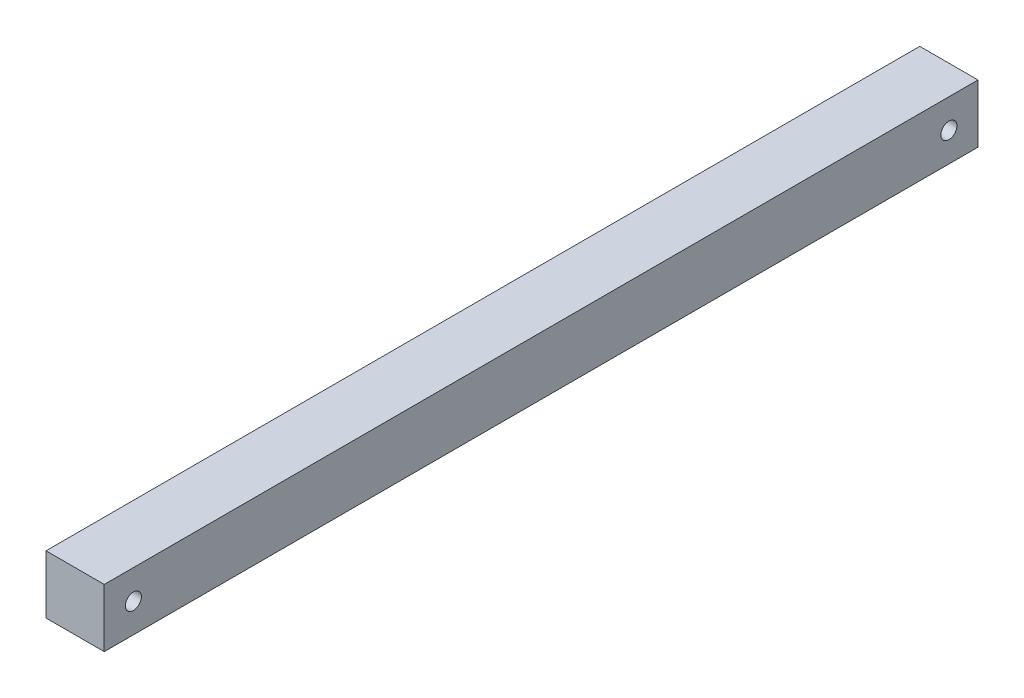
ISO-10303-21;
HEADER;
FILE_DESCRIPTION(('STEP AP214'),'2;1');
FILE_NAME('part.step','',(''),(''),'','','');
FILE_SCHEMA(('AUTOMOTIVE_DESIGN { 1 0 10303 214 1 1 1 1 }'));
ENDSEC;
DATA;
#1=APPLICATION_CONTEXT('core data for automotive mechanical design processes');
#2=APPLICATION_PROTOCOL_DEFINITION('international standard','automotive_design',2000,#1);
#3=PRODUCT_CONTEXT('',#1,'mechanical');
#4=PRODUCT('Part','Part','',(#3));
#5=PRODUCT_RELATED_PRODUCT_CATEGORY('part','',(#4));
#6=PRODUCT_DEFINITION_FORMATION('','',#4);
#7=PRODUCT_DEFINITION_CONTEXT('part definition',#1,'design');
#8=PRODUCT_DEFINITION('design','',#6,#7);
#9=PRODUCT_DEFINITION_SHAPE('','',#8);
#10=(LENGTH_UNIT() NAMED_UNIT(*) SI_UNIT(.MILLI.,.METRE.));
#11=(NAMED_UNIT(*) PLANE_ANGLE_UNIT() SI_UNIT($,.RADIAN.));
#12=(NAMED_UNIT(*) SI_UNIT($,.STERADIAN.) SOLID_ANGLE_UNIT());
#13=UNCERTAINTY_MEASURE_WITH_UNIT(LENGTH_MEASURE(1.E-05),#10,'distance_accuracy_value','');
#14=(GEOMETRIC_REPRESENTATION_CONTEXT(3) GLOBAL_UNCERTAINTY_ASSIGNED_CONTEXT((#13)) GLOBAL_UNIT_ASSIGNED_CONTEXT((#10,
#11,#12)) REPRESENTATION_CONTEXT('',''));
#15=CARTESIAN_POINT('',(0.,0.,0.));
#16=DIRECTION('',(0.,0.,1.));
#17=DIRECTION('',(1.,0.,0.));
#18=AXIS2_PLACEMENT_3D('',#15,#16,#17);
#19=CARTESIAN_POINT('',(12.7,-12.7,381.));
#20=DIRECTION('',(-1.,0.,0.));
#21=DIRECTION('',(0.,0.,1.));
#22=AXIS2_PLACEMENT_3D('',#19,#20,#21);
#23=PLANE('',#22);
#24=CARTESIAN_POINT('',(12.7,0.,368.3));
#25=DIRECTION('',(-1.,0.,0.));
#26=DIRECTION('',(0.,0.,1.));
#27=AXIS2_PLACEMENT_3D('',#24,#25,#26);
#28=CIRCLE('',#27,3.50000000000002);
#29=CARTESIAN_POINT('',(12.7,0.,371.8));
#30=VERTEX_POINT('',#29);
#31=EDGE_CURVE('E111',#30,#30,#28,.T.);
#32=ORIENTED_EDGE('',*,*,#31,.T.);
#33=EDGE_LOOP('',(#32));
#34=FACE_BOUND('',#33,.T.);
#35=CARTESIAN_POINT('',(12.7,0.,12.7));
#36=DIRECTION('',(-1.,0.,0.));
#37=DIRECTION('',(0.,0.,-1.));
#38=AXIS2_PLACEMENT_3D('',#35,#36,#37);
#39=CIRCLE('',#38,3.50000000000003);
#40=CARTESIAN_POINT('',(12.7,0.,9.19999999999996));
#41=VERTEX_POINT('',#40);
#42=EDGE_CURVE('E132',#41,#41,#39,.T.);
#43=ORIENTED_EDGE('',*,*,#42,.T.);
#44=EDGE_LOOP('',(#43));
#45=FACE_BOUND('',#44,.T.);
#46=DIRECTION('',(0.,1.,0.));
#47=VECTOR('',#46,1.);
#48=CARTESIAN_POINT('',(12.7,-12.7,0.));
#49=LINE('',#48,#47);
#50=CARTESIAN_POINT('',(12.7,-12.7,0.));
#51=VERTEX_POINT('',#50);
#52=CARTESIAN_POINT('',(12.7,12.7,0.));
#53=VERTEX_POINT('',#52);
#54=EDGE_CURVE('E107',#51,#53,#49,.T.);
#55=ORIENTED_EDGE('',*,*,#54,.T.);
#56=DIRECTION('',(0.,0.,-1.));
#57=VECTOR('',#56,1.);
#58=CARTESIAN_POINT('',(12.7,12.7,381.));
#59=LINE('',#58,#57);
#60=CARTESIAN_POINT('',(12.7,12.7,381.));
#61=VERTEX_POINT('',#60);
#62=EDGE_CURVE('E11',#61,#53,#59,.T.);
#63=ORIENTED_EDGE('',*,*,#62,.F.);
#64=DIRECTION('',(0.,1.,0.));
#65=VECTOR('',#64,1.);
#66=CARTESIAN_POINT('',(12.7,-12.7,381.));
#67=LINE('',#66,#65);
#68=CARTESIAN_POINT('',(12.7,-12.7,381.));
#69=VERTEX_POINT('',#68);
#70=EDGE_CURVE('E91',#69,#61,#67,.T.);
#71=ORIENTED_EDGE('',*,*,#70,.F.);
#72=DIRECTION('',(0.,0.,-1.));
#73=VECTOR('',#72,1.);
#74=CARTESIAN_POINT('',(12.7,-12.7,381.));
#75=LINE('',#74,#73);
#76=EDGE_CURVE('E103',#69,#51,#75,.T.);
#77=ORIENTED_EDGE('',*,*,#76,.T.);
#78=EDGE_LOOP('',(#55,#63,#71,#77));
#79=FACE_BOUND('',#78,.T.);
#80=ADVANCED_FACE('F39',(#34,#45,#79),#23,.F.);
#81=CARTESIAN_POINT('',(-12.7,12.7,381.));
#82=DIRECTION('',(0.,-1.,0.));
#83=DIRECTION('',(0.,0.,-1.));
#84=AXIS2_PLACEMENT_3D('',#81,#82,#83);
#85=PLANE('',#84);
#86=DIRECTION('',(-1.,0.,0.));
#87=VECTOR('',#86,1.);
#88=CARTESIAN_POINT('',(-12.7,12.7,0.));
#89=LINE('',#88,#87);
#90=CARTESIAN_POINT('',(-12.7,12.7,0.));
#91=VERTEX_POINT('',#90);
#92=EDGE_CURVE('E96',#53,#91,#89,.T.);
#93=ORIENTED_EDGE('',*,*,#92,.T.);
#94=DIRECTION('',(0.,0.,-1.));
#95=VECTOR('',#94,1.);
#96=CARTESIAN_POINT('',(-12.7,12.7,381.));
#97=LINE('',#96,#95);
#98=CARTESIAN_POINT('',(-12.7,12.7,381.));
#99=VERTEX_POINT('',#98);
#100=EDGE_CURVE('E48',#99,#91,#97,.T.);
#101=ORIENTED_EDGE('',*,*,#100,.F.);
#102=DIRECTION('',(-1.,0.,0.));
#103=VECTOR('',#102,1.);
#104=CARTESIAN_POINT('',(-12.7,12.7,381.));
#105=LINE('',#104,#103);
#106=EDGE_CURVE('E86',#61,#99,#105,.T.);
#107=ORIENTED_EDGE('',*,*,#106,.F.);
#108=ORIENTED_EDGE('',*,*,#62,.T.);
#109=EDGE_LOOP('',(#93,#101,#107,#108));
#110=FACE_BOUND('',#109,.T.);
#111=ADVANCED_FACE('F95',(#110),#85,.F.);
#112=CARTESIAN_POINT('',(-12.7,-12.7,381.));
#113=DIRECTION('',(1.,0.,0.));
#114=DIRECTION('',(0.,0.,-1.));
#115=AXIS2_PLACEMENT_3D('',#112,#113,#114);
#116=PLANE('',#115);
#117=CARTESIAN_POINT('',(-12.7,0.,368.3));
#118=DIRECTION('',(-1.,0.,0.));
#119=DIRECTION('',(0.,0.,1.));
#120=AXIS2_PLACEMENT_3D('',#117,#118,#119);
#121=CIRCLE('',#120,3.50000000000002);
#122=CARTESIAN_POINT('',(-12.7,0.,371.8));
#123=VERTEX_POINT('',#122);
#124=EDGE_CURVE('E136',#123,#123,#121,.T.);
#125=ORIENTED_EDGE('',*,*,#124,.F.);
#126=EDGE_LOOP('',(#125));
#127=FACE_BOUND('',#126,.T.);
#128=CARTESIAN_POINT('',(-12.7,0.,12.7));
#129=DIRECTION('',(-1.,0.,0.));
#130=DIRECTION('',(0.,0.,-1.));
#131=AXIS2_PLACEMENT_3D('',#128,#129,#130);
#132=CIRCLE('',#131,3.50000000000003);
#133=CARTESIAN_POINT('',(-12.7,0.,9.19999999999996));
#134=VERTEX_POINT('',#133);
#135=EDGE_CURVE('E128',#134,#134,#132,.T.);
#136=ORIENTED_EDGE('',*,*,#135,.F.);
#137=EDGE_LOOP('',(#136));
#138=FACE_BOUND('',#137,.T.);
#139=DIRECTION('',(0.,-1.,0.));
#140=VECTOR('',#139,1.);
#141=CARTESIAN_POINT('',(-12.7,-12.7,0.));
#142=LINE('',#141,#140);
#143=CARTESIAN_POINT('',(-12.7,-12.7,0.));
#144=VERTEX_POINT('',#143);
#145=EDGE_CURVE('E73',#91,#144,#142,.T.);
#146=ORIENTED_EDGE('',*,*,#145,.T.);
#147=DIRECTION('',(0.,0.,-1.));
#148=VECTOR('',#147,1.);
#149=CARTESIAN_POINT('',(-12.7,-12.7,381.));
#150=LINE('',#149,#148);
#151=CARTESIAN_POINT('',(-12.7,-12.7,381.));
#152=VERTEX_POINT('',#151);
#153=EDGE_CURVE('E98',#152,#144,#150,.T.);
#154=ORIENTED_EDGE('',*,*,#153,.F.);
#155=DIRECTION('',(0.,-1.,0.));
#156=VECTOR('',#155,1.);
#157=CARTESIAN_POINT('',(-12.7,-12.7,381.));
#158=LINE('',#157,#156);
#159=EDGE_CURVE('E89',#99,#152,#158,.T.);
#160=ORIENTED_EDGE('',*,*,#159,.F.);
#161=ORIENTED_EDGE('',*,*,#100,.T.);
#162=EDGE_LOOP('',(#146,#154,#160,#161));
#163=FACE_BOUND('',#162,.T.);
#164=ADVANCED_FACE('F99',(#127,#138,#163),#116,.F.);
#165=CARTESIAN_POINT('',(-12.7,-12.7,381.));
#166=DIRECTION('',(0.,1.,0.));
#167=DIRECTION('',(0.,0.,1.));
#168=AXIS2_PLACEMENT_3D('',#165,#166,#167);
#169=PLANE('',#168);
#170=DIRECTION('',(1.,0.,0.));
#171=VECTOR('',#170,1.);
#172=CARTESIAN_POINT('',(-12.7,-12.7,0.));
#173=LINE('',#172,#171);
#174=EDGE_CURVE('E79',#144,#51,#173,.T.);
#175=ORIENTED_EDGE('',*,*,#174,.T.);
#176=ORIENTED_EDGE('',*,*,#76,.F.);
#177=DIRECTION('',(1.,0.,0.));
#178=VECTOR('',#177,1.);
#179=CARTESIAN_POINT('',(-12.7,-12.7,381.));
#180=LINE('',#179,#178);
#181=EDGE_CURVE('E56',#152,#69,#180,.T.);
#182=ORIENTED_EDGE('',*,*,#181,.F.);
#183=ORIENTED_EDGE('',*,*,#153,.T.);
#184=EDGE_LOOP('',(#175,#176,#182,#183));
#185=FACE_BOUND('',#184,.T.);
#186=ADVANCED_FACE('F121',(#185),#169,.F.);
#187=CARTESIAN_POINT('',(0.,0.,381.));
#188=DIRECTION('',(0.,0.,-1.));
#189=DIRECTION('',(-1.,0.,0.));
#190=AXIS2_PLACEMENT_3D('',#187,#188,#189);
#191=PLANE('',#190);
#192=ORIENTED_EDGE('',*,*,#70,.T.);
#193=ORIENTED_EDGE('',*,*,#106,.T.);
#194=ORIENTED_EDGE('',*,*,#159,.T.);
#195=ORIENTED_EDGE('',*,*,#181,.T.);
#196=EDGE_LOOP('',(#192,#193,#194,#195));
#197=FACE_BOUND('',#196,.T.);
#198=ADVANCED_FACE('F87',(#197),#191,.F.);
#199=CARTESIAN_POINT('',(0.,0.,0.));
#200=DIRECTION('',(0.,0.,-1.));
#201=DIRECTION('',(-1.,0.,0.));
#202=AXIS2_PLACEMENT_3D('',#199,#200,#201);
#203=PLANE('',#202);
#204=ORIENTED_EDGE('',*,*,#54,.F.);
#205=ORIENTED_EDGE('',*,*,#174,.F.);
#206=ORIENTED_EDGE('',*,*,#145,.F.);
#207=ORIENTED_EDGE('',*,*,#92,.F.);
#208=EDGE_LOOP('',(#204,#205,#206,#207));
#209=FACE_BOUND('',#208,.T.);
#210=ADVANCED_FACE('F124',(#209),#203,.T.);
#211=CARTESIAN_POINT('',(12.7,0.,12.7));
#212=DIRECTION('',(-1.,0.,0.));
#213=DIRECTION('',(0.,0.,1.));
#214=AXIS2_PLACEMENT_3D('',#211,#212,#213);
#215=CYLINDRICAL_SURFACE('',#214,3.50000000000003);
#216=ORIENTED_EDGE('',*,*,#42,.F.);
#217=EDGE_LOOP('',(#216));
#218=FACE_BOUND('',#217,.T.);
#219=ORIENTED_EDGE('',*,*,#135,.T.);
#220=EDGE_LOOP('',(#219));
#221=FACE_BOUND('',#220,.T.);
#222=ADVANCED_FACE('F149',(#218,#221),#215,.F.);
#223=CARTESIAN_POINT('',(12.7,0.,368.3));
#224=DIRECTION('',(-1.,0.,0.));
#225=DIRECTION('',(0.,0.,1.));
#226=AXIS2_PLACEMENT_3D('',#223,#224,#225);
#227=CYLINDRICAL_SURFACE('',#226,3.50000000000002);
#228=ORIENTED_EDGE('',*,*,#31,.F.);
#229=EDGE_LOOP('',(#228));
#230=FACE_BOUND('',#229,.T.);
#231=ORIENTED_EDGE('',*,*,#124,.T.);
#232=EDGE_LOOP('',(#231));
#233=FACE_BOUND('',#232,.T.);
#234=ADVANCED_FACE('F146',(#230,#233),#227,.F.);
#235=CLOSED_SHELL('',(#80,#111,#164,#186,#198,#210,#222,#234));
#236=MANIFOLD_SOLID_BREP('B2',#235);
#237=ADVANCED_BREP_SHAPE_REPRESENTATION('',(#18,#236),#14);
#238=SHAPE_DEFINITION_REPRESENTATION(#9,#237);
ENDSEC;
END-ISO-10303-21;
